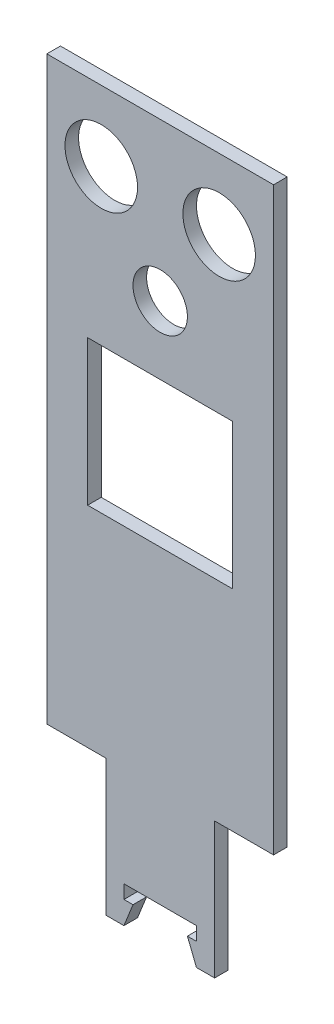
ISO-10303-21;
HEADER;
FILE_DESCRIPTION(('STEP AP214'),'2;1');
FILE_NAME('part.step','',(''),(''),'','','');
FILE_SCHEMA(('AUTOMOTIVE_DESIGN { 1 0 10303 214 1 1 1 1 }'));
ENDSEC;
DATA;
#1=APPLICATION_CONTEXT('core data for automotive mechanical design processes');
#2=APPLICATION_PROTOCOL_DEFINITION('international standard','automotive_design',2000,#1);
#3=PRODUCT_CONTEXT('',#1,'mechanical');
#4=PRODUCT('Part','Part','',(#3));
#5=PRODUCT_RELATED_PRODUCT_CATEGORY('part','',(#4));
#6=PRODUCT_DEFINITION_FORMATION('','',#4);
#7=PRODUCT_DEFINITION_CONTEXT('part definition',#1,'design');
#8=PRODUCT_DEFINITION('design','',#6,#7);
#9=PRODUCT_DEFINITION_SHAPE('','',#8);
#10=(LENGTH_UNIT() NAMED_UNIT(*) SI_UNIT(.MILLI.,.METRE.));
#11=(NAMED_UNIT(*) PLANE_ANGLE_UNIT() SI_UNIT($,.RADIAN.));
#12=(NAMED_UNIT(*) SI_UNIT($,.STERADIAN.) SOLID_ANGLE_UNIT());
#13=UNCERTAINTY_MEASURE_WITH_UNIT(LENGTH_MEASURE(1.E-05),#10,'distance_accuracy_value','');
#14=(GEOMETRIC_REPRESENTATION_CONTEXT(3) GLOBAL_UNCERTAINTY_ASSIGNED_CONTEXT((#13)) GLOBAL_UNIT_ASSIGNED_CONTEXT((#10,
#11,#12)) REPRESENTATION_CONTEXT('',''));
#15=CARTESIAN_POINT('',(0.,0.,0.));
#16=DIRECTION('',(0.,0.,1.));
#17=DIRECTION('',(1.,0.,0.));
#18=AXIS2_PLACEMENT_3D('',#15,#16,#17);
#19=CARTESIAN_POINT('',(0.,0.,3.));
#20=DIRECTION('',(0.,0.,1.));
#21=DIRECTION('',(1.,0.,0.));
#22=AXIS2_PLACEMENT_3D('',#19,#20,#21);
#23=PLANE('',#22);
#24=CARTESIAN_POINT('',(20.7498,74.50776192,3.));
#25=DIRECTION('',(0.,0.,1.));
#26=DIRECTION('',(1.,0.,0.));
#27=AXIS2_PLACEMENT_3D('',#24,#25,#26);
#28=CIRCLE('',#27,8.);
#29=CARTESIAN_POINT('',(28.7498,74.50776192,3.));
#30=VERTEX_POINT('',#29);
#31=EDGE_CURVE('E212',#30,#30,#28,.T.);
#32=ORIENTED_EDGE('',*,*,#31,.F.);
#33=EDGE_LOOP('',(#32));
#34=FACE_BOUND('',#33,.T.);
#35=DIRECTION('',(-1.,0.,0.));
#36=VECTOR('',#35,1.);
#37=CARTESIAN_POINT('',(58.7498,90.00776192,3.));
#38=LINE('',#37,#36);
#39=CARTESIAN_POINT('',(58.7498,90.00776192,3.));
#40=VERTEX_POINT('',#39);
#41=CARTESIAN_POINT('',(8.74979999999999,90.00776192,3.));
#42=VERTEX_POINT('',#41);
#43=EDGE_CURVE('E224',#40,#42,#38,.T.);
#44=ORIENTED_EDGE('',*,*,#43,.T.);
#45=DIRECTION('',(0.,-1.,0.));
#46=VECTOR('',#45,1.);
#47=CARTESIAN_POINT('',(8.74979999999999,90.00776192,3.));
#48=LINE('',#47,#46);
#49=CARTESIAN_POINT('',(8.74979999999999,-37.99223808,3.));
#50=VERTEX_POINT('',#49);
#51=EDGE_CURVE('E227',#42,#50,#48,.T.);
#52=ORIENTED_EDGE('',*,*,#51,.T.);
#53=DIRECTION('',(1.,0.,0.));
#54=VECTOR('',#53,1.);
#55=CARTESIAN_POINT('',(8.74979999999999,-37.99223808,3.));
#56=LINE('',#55,#54);
#57=CARTESIAN_POINT('',(21.7498,-37.99223808,3.));
#58=VERTEX_POINT('',#57);
#59=EDGE_CURVE('E230',#50,#58,#56,.T.);
#60=ORIENTED_EDGE('',*,*,#59,.T.);
#61=DIRECTION('',(0.,-1.,0.));
#62=VECTOR('',#61,1.);
#63=CARTESIAN_POINT('',(21.7498,-37.99223808,3.));
#64=LINE('',#63,#62);
#65=CARTESIAN_POINT('',(21.7498,-67.99223808,3.));
#66=VERTEX_POINT('',#65);
#67=EDGE_CURVE('E232',#58,#66,#64,.T.);
#68=ORIENTED_EDGE('',*,*,#67,.T.);
#69=DIRECTION('',(1.,0.,0.));
#70=VECTOR('',#69,1.);
#71=CARTESIAN_POINT('',(21.7498,-67.99223808,3.));
#72=LINE('',#71,#70);
#73=CARTESIAN_POINT('',(25.7498,-67.99223808,3.));
#74=VERTEX_POINT('',#73);
#75=EDGE_CURVE('E234',#66,#74,#72,.T.);
#76=ORIENTED_EDGE('',*,*,#75,.T.);
#77=DIRECTION('',(0.371390676354105,0.928476690885259,0.));
#78=VECTOR('',#77,1.);
#79=CARTESIAN_POINT('',(25.7498,-67.99223808,3.));
#80=LINE('',#79,#78);
#81=CARTESIAN_POINT('',(27.7498,-62.99223808,3.));
#82=VERTEX_POINT('',#81);
#83=EDGE_CURVE('E236',#74,#82,#80,.T.);
#84=ORIENTED_EDGE('',*,*,#83,.T.);
#85=DIRECTION('',(-1.,0.,0.));
#86=VECTOR('',#85,1.);
#87=CARTESIAN_POINT('',(27.7498,-62.99223808,3.));
#88=LINE('',#87,#86);
#89=CARTESIAN_POINT('',(25.7498,-62.99223808,3.));
#90=VERTEX_POINT('',#89);
#91=EDGE_CURVE('E238',#82,#90,#88,.T.);
#92=ORIENTED_EDGE('',*,*,#91,.T.);
#93=DIRECTION('',(0.,1.,0.));
#94=VECTOR('',#93,1.);
#95=CARTESIAN_POINT('',(25.7498,-62.99223808,3.));
#96=LINE('',#95,#94);
#97=CARTESIAN_POINT('',(25.7498,-59.99223808,3.));
#98=VERTEX_POINT('',#97);
#99=EDGE_CURVE('E240',#90,#98,#96,.T.);
#100=ORIENTED_EDGE('',*,*,#99,.T.);
#101=DIRECTION('',(1.,0.,0.));
#102=VECTOR('',#101,1.);
#103=CARTESIAN_POINT('',(25.7498,-59.99223808,3.));
#104=LINE('',#103,#102);
#105=CARTESIAN_POINT('',(41.7498,-59.99223808,3.));
#106=VERTEX_POINT('',#105);
#107=EDGE_CURVE('E242',#98,#106,#104,.T.);
#108=ORIENTED_EDGE('',*,*,#107,.T.);
#109=DIRECTION('',(0.,-1.,0.));
#110=VECTOR('',#109,1.);
#111=CARTESIAN_POINT('',(41.7498,-59.99223808,3.));
#112=LINE('',#111,#110);
#113=CARTESIAN_POINT('',(41.7498,-62.99223808,3.));
#114=VERTEX_POINT('',#113);
#115=EDGE_CURVE('E244',#106,#114,#112,.T.);
#116=ORIENTED_EDGE('',*,*,#115,.T.);
#117=DIRECTION('',(-1.,0.,0.));
#118=VECTOR('',#117,1.);
#119=CARTESIAN_POINT('',(41.7498,-62.99223808,3.));
#120=LINE('',#119,#118);
#121=CARTESIAN_POINT('',(39.7498,-62.99223808,3.));
#122=VERTEX_POINT('',#121);
#123=EDGE_CURVE('E246',#114,#122,#120,.T.);
#124=ORIENTED_EDGE('',*,*,#123,.T.);
#125=DIRECTION('',(0.371390676354105,-0.928476690885259,0.));
#126=VECTOR('',#125,1.);
#127=CARTESIAN_POINT('',(39.7498,-62.99223808,3.));
#128=LINE('',#127,#126);
#129=CARTESIAN_POINT('',(41.7498,-67.99223808,3.));
#130=VERTEX_POINT('',#129);
#131=EDGE_CURVE('E248',#122,#130,#128,.T.);
#132=ORIENTED_EDGE('',*,*,#131,.T.);
#133=DIRECTION('',(1.,0.,0.));
#134=VECTOR('',#133,1.);
#135=CARTESIAN_POINT('',(41.7498,-67.99223808,3.));
#136=LINE('',#135,#134);
#137=CARTESIAN_POINT('',(45.7498,-67.99223808,3.));
#138=VERTEX_POINT('',#137);
#139=EDGE_CURVE('E250',#130,#138,#136,.T.);
#140=ORIENTED_EDGE('',*,*,#139,.T.);
#141=DIRECTION('',(0.,1.,0.));
#142=VECTOR('',#141,1.);
#143=CARTESIAN_POINT('',(45.7498,-67.99223808,3.));
#144=LINE('',#143,#142);
#145=CARTESIAN_POINT('',(45.7498,-37.99223808,3.));
#146=VERTEX_POINT('',#145);
#147=EDGE_CURVE('E252',#138,#146,#144,.T.);
#148=ORIENTED_EDGE('',*,*,#147,.T.);
#149=DIRECTION('',(1.,0.,0.));
#150=VECTOR('',#149,1.);
#151=CARTESIAN_POINT('',(45.7498,-37.99223808,3.));
#152=LINE('',#151,#150);
#153=CARTESIAN_POINT('',(58.7498,-37.99223808,3.));
#154=VERTEX_POINT('',#153);
#155=EDGE_CURVE('E254',#146,#154,#152,.T.);
#156=ORIENTED_EDGE('',*,*,#155,.T.);
#157=DIRECTION('',(0.,1.,0.));
#158=VECTOR('',#157,1.);
#159=CARTESIAN_POINT('',(58.7498,90.00776192,3.));
#160=LINE('',#159,#158);
#161=EDGE_CURVE('E256',#154,#40,#160,.T.);
#162=ORIENTED_EDGE('',*,*,#161,.T.);
#163=EDGE_LOOP('',(#44,#52,#60,#68,#76,#84,#92,#100,#108,#116,#124,#132,#140,#148,#156,#162));
#164=FACE_BOUND('',#163,.T.);
#165=CARTESIAN_POINT('',(33.7498,55.30776192,3.));
#166=DIRECTION('',(0.,0.,1.));
#167=DIRECTION('',(1.,0.,0.));
#168=AXIS2_PLACEMENT_3D('',#165,#166,#167);
#169=CIRCLE('',#168,6.);
#170=CARTESIAN_POINT('',(39.7498,55.30776192,3.));
#171=VERTEX_POINT('',#170);
#172=EDGE_CURVE('E218',#171,#171,#169,.T.);
#173=ORIENTED_EDGE('',*,*,#172,.F.);
#174=EDGE_LOOP('',(#173));
#175=FACE_BOUND('',#174,.T.);
#176=CARTESIAN_POINT('',(46.7498,74.50776192,3.));
#177=DIRECTION('',(0.,0.,1.));
#178=DIRECTION('',(1.,0.,0.));
#179=AXIS2_PLACEMENT_3D('',#176,#177,#178);
#180=CIRCLE('',#179,8.);
#181=CARTESIAN_POINT('',(54.7498,74.50776192,3.));
#182=VERTEX_POINT('',#181);
#183=EDGE_CURVE('E206',#182,#182,#180,.T.);
#184=ORIENTED_EDGE('',*,*,#183,.F.);
#185=EDGE_LOOP('',(#184));
#186=FACE_BOUND('',#185,.T.);
#187=DIRECTION('',(0.,-1.,0.));
#188=VECTOR('',#187,1.);
#189=CARTESIAN_POINT('',(17.7498,8.30776191999998,3.));
#190=LINE('',#189,#188);
#191=CARTESIAN_POINT('',(17.7498,40.30776192,3.));
#192=VERTEX_POINT('',#191);
#193=CARTESIAN_POINT('',(17.7498,8.30776191999998,3.));
#194=VERTEX_POINT('',#193);
#195=EDGE_CURVE('E178',#192,#194,#190,.T.);
#196=ORIENTED_EDGE('',*,*,#195,.F.);
#197=DIRECTION('',(-1.,0.,0.));
#198=VECTOR('',#197,1.);
#199=CARTESIAN_POINT('',(17.7498,40.30776192,3.));
#200=LINE('',#199,#198);
#201=CARTESIAN_POINT('',(49.7498,40.30776192,3.));
#202=VERTEX_POINT('',#201);
#203=EDGE_CURVE('E170',#202,#192,#200,.T.);
#204=ORIENTED_EDGE('',*,*,#203,.F.);
#205=DIRECTION('',(0.,1.,0.));
#206=VECTOR('',#205,1.);
#207=CARTESIAN_POINT('',(49.7498,40.30776192,3.));
#208=LINE('',#207,#206);
#209=CARTESIAN_POINT('',(49.7498,8.30776191999998,3.));
#210=VERTEX_POINT('',#209);
#211=EDGE_CURVE('E192',#210,#202,#208,.T.);
#212=ORIENTED_EDGE('',*,*,#211,.F.);
#213=DIRECTION('',(1.,0.,0.));
#214=VECTOR('',#213,1.);
#215=CARTESIAN_POINT('',(49.7498,8.30776191999998,3.));
#216=LINE('',#215,#214);
#217=EDGE_CURVE('E190',#194,#210,#216,.T.);
#218=ORIENTED_EDGE('',*,*,#217,.F.);
#219=EDGE_LOOP('',(#196,#204,#212,#218));
#220=FACE_BOUND('',#219,.T.);
#221=ADVANCED_FACE('F33',(#34,#164,#175,#186,#220),#23,.T.);
#222=CARTESIAN_POINT('',(0.,0.,0.));
#223=DIRECTION('',(0.,0.,1.));
#224=DIRECTION('',(1.,0.,0.));
#225=AXIS2_PLACEMENT_3D('',#222,#223,#224);
#226=PLANE('',#225);
#227=CARTESIAN_POINT('',(46.7498,74.50776192,0.));
#228=DIRECTION('',(0.,0.,1.));
#229=DIRECTION('',(1.,0.,0.));
#230=AXIS2_PLACEMENT_3D('',#227,#228,#229);
#231=CIRCLE('',#230,8.);
#232=CARTESIAN_POINT('',(54.7498,74.50776192,0.));
#233=VERTEX_POINT('',#232);
#234=EDGE_CURVE('E186',#233,#233,#231,.T.);
#235=ORIENTED_EDGE('',*,*,#234,.T.);
#236=EDGE_LOOP('',(#235));
#237=FACE_BOUND('',#236,.T.);
#238=CARTESIAN_POINT('',(20.7498,74.50776192,0.));
#239=DIRECTION('',(0.,0.,1.));
#240=DIRECTION('',(1.,0.,0.));
#241=AXIS2_PLACEMENT_3D('',#238,#239,#240);
#242=CIRCLE('',#241,8.);
#243=CARTESIAN_POINT('',(28.7498,74.50776192,0.));
#244=VERTEX_POINT('',#243);
#245=EDGE_CURVE('E209',#244,#244,#242,.T.);
#246=ORIENTED_EDGE('',*,*,#245,.T.);
#247=EDGE_LOOP('',(#246));
#248=FACE_BOUND('',#247,.T.);
#249=CARTESIAN_POINT('',(33.7498,55.30776192,0.));
#250=DIRECTION('',(0.,0.,1.));
#251=DIRECTION('',(1.,0.,0.));
#252=AXIS2_PLACEMENT_3D('',#249,#250,#251);
#253=CIRCLE('',#252,6.);
#254=CARTESIAN_POINT('',(39.7498,55.30776192,0.));
#255=VERTEX_POINT('',#254);
#256=EDGE_CURVE('E215',#255,#255,#253,.T.);
#257=ORIENTED_EDGE('',*,*,#256,.T.);
#258=EDGE_LOOP('',(#257));
#259=FACE_BOUND('',#258,.T.);
#260=DIRECTION('',(-1.,0.,0.));
#261=VECTOR('',#260,1.);
#262=CARTESIAN_POINT('',(58.7498,90.00776192,0.));
#263=LINE('',#262,#261);
#264=CARTESIAN_POINT('',(58.7498,90.00776192,0.));
#265=VERTEX_POINT('',#264);
#266=CARTESIAN_POINT('',(8.74979999999999,90.00776192,0.));
#267=VERTEX_POINT('',#266);
#268=EDGE_CURVE('E221',#265,#267,#263,.T.);
#269=ORIENTED_EDGE('',*,*,#268,.F.);
#270=DIRECTION('',(0.,1.,0.));
#271=VECTOR('',#270,1.);
#272=CARTESIAN_POINT('',(58.7498,90.00776192,0.));
#273=LINE('',#272,#271);
#274=CARTESIAN_POINT('',(58.7498,-37.99223808,0.));
#275=VERTEX_POINT('',#274);
#276=EDGE_CURVE('E228',#275,#265,#273,.T.);
#277=ORIENTED_EDGE('',*,*,#276,.F.);
#278=DIRECTION('',(1.,0.,0.));
#279=VECTOR('',#278,1.);
#280=CARTESIAN_POINT('',(45.7498,-37.99223808,0.));
#281=LINE('',#280,#279);
#282=CARTESIAN_POINT('',(45.7498,-37.99223808,0.));
#283=VERTEX_POINT('',#282);
#284=EDGE_CURVE('E287',#283,#275,#281,.T.);
#285=ORIENTED_EDGE('',*,*,#284,.F.);
#286=DIRECTION('',(0.,1.,0.));
#287=VECTOR('',#286,1.);
#288=CARTESIAN_POINT('',(45.7498,-67.99223808,0.));
#289=LINE('',#288,#287);
#290=CARTESIAN_POINT('',(45.7498,-67.99223808,0.));
#291=VERTEX_POINT('',#290);
#292=EDGE_CURVE('E285',#291,#283,#289,.T.);
#293=ORIENTED_EDGE('',*,*,#292,.F.);
#294=DIRECTION('',(1.,0.,0.));
#295=VECTOR('',#294,1.);
#296=CARTESIAN_POINT('',(41.7498,-67.99223808,0.));
#297=LINE('',#296,#295);
#298=CARTESIAN_POINT('',(41.7498,-67.99223808,0.));
#299=VERTEX_POINT('',#298);
#300=EDGE_CURVE('E283',#299,#291,#297,.T.);
#301=ORIENTED_EDGE('',*,*,#300,.F.);
#302=DIRECTION('',(0.371390676354105,-0.928476690885259,0.));
#303=VECTOR('',#302,1.);
#304=CARTESIAN_POINT('',(39.7498,-62.99223808,0.));
#305=LINE('',#304,#303);
#306=CARTESIAN_POINT('',(39.7498,-62.99223808,0.));
#307=VERTEX_POINT('',#306);
#308=EDGE_CURVE('E281',#307,#299,#305,.T.);
#309=ORIENTED_EDGE('',*,*,#308,.F.);
#310=DIRECTION('',(-1.,0.,0.));
#311=VECTOR('',#310,1.);
#312=CARTESIAN_POINT('',(41.7498,-62.99223808,0.));
#313=LINE('',#312,#311);
#314=CARTESIAN_POINT('',(41.7498,-62.99223808,0.));
#315=VERTEX_POINT('',#314);
#316=EDGE_CURVE('E279',#315,#307,#313,.T.);
#317=ORIENTED_EDGE('',*,*,#316,.F.);
#318=DIRECTION('',(0.,-1.,0.));
#319=VECTOR('',#318,1.);
#320=CARTESIAN_POINT('',(41.7498,-59.99223808,0.));
#321=LINE('',#320,#319);
#322=CARTESIAN_POINT('',(41.7498,-59.99223808,0.));
#323=VERTEX_POINT('',#322);
#324=EDGE_CURVE('E277',#323,#315,#321,.T.);
#325=ORIENTED_EDGE('',*,*,#324,.F.);
#326=DIRECTION('',(1.,0.,0.));
#327=VECTOR('',#326,1.);
#328=CARTESIAN_POINT('',(25.7498,-59.99223808,0.));
#329=LINE('',#328,#327);
#330=CARTESIAN_POINT('',(25.7498,-59.99223808,0.));
#331=VERTEX_POINT('',#330);
#332=EDGE_CURVE('E275',#331,#323,#329,.T.);
#333=ORIENTED_EDGE('',*,*,#332,.F.);
#334=DIRECTION('',(0.,1.,0.));
#335=VECTOR('',#334,1.);
#336=CARTESIAN_POINT('',(25.7498,-62.99223808,0.));
#337=LINE('',#336,#335);
#338=CARTESIAN_POINT('',(25.7498,-62.99223808,0.));
#339=VERTEX_POINT('',#338);
#340=EDGE_CURVE('E273',#339,#331,#337,.T.);
#341=ORIENTED_EDGE('',*,*,#340,.F.);
#342=DIRECTION('',(-1.,0.,0.));
#343=VECTOR('',#342,1.);
#344=CARTESIAN_POINT('',(27.7498,-62.99223808,0.));
#345=LINE('',#344,#343);
#346=CARTESIAN_POINT('',(27.7498,-62.99223808,0.));
#347=VERTEX_POINT('',#346);
#348=EDGE_CURVE('E271',#347,#339,#345,.T.);
#349=ORIENTED_EDGE('',*,*,#348,.F.);
#350=DIRECTION('',(0.371390676354105,0.928476690885259,0.));
#351=VECTOR('',#350,1.);
#352=CARTESIAN_POINT('',(25.7498,-67.99223808,0.));
#353=LINE('',#352,#351);
#354=CARTESIAN_POINT('',(25.7498,-67.99223808,0.));
#355=VERTEX_POINT('',#354);
#356=EDGE_CURVE('E269',#355,#347,#353,.T.);
#357=ORIENTED_EDGE('',*,*,#356,.F.);
#358=DIRECTION('',(1.,0.,0.));
#359=VECTOR('',#358,1.);
#360=CARTESIAN_POINT('',(21.7498,-67.99223808,0.));
#361=LINE('',#360,#359);
#362=CARTESIAN_POINT('',(21.7498,-67.99223808,0.));
#363=VERTEX_POINT('',#362);
#364=EDGE_CURVE('E267',#363,#355,#361,.T.);
#365=ORIENTED_EDGE('',*,*,#364,.F.);
#366=DIRECTION('',(0.,-1.,0.));
#367=VECTOR('',#366,1.);
#368=CARTESIAN_POINT('',(21.7498,-37.99223808,0.));
#369=LINE('',#368,#367);
#370=CARTESIAN_POINT('',(21.7498,-37.99223808,0.));
#371=VERTEX_POINT('',#370);
#372=EDGE_CURVE('E265',#371,#363,#369,.T.);
#373=ORIENTED_EDGE('',*,*,#372,.F.);
#374=DIRECTION('',(1.,0.,0.));
#375=VECTOR('',#374,1.);
#376=CARTESIAN_POINT('',(8.74979999999999,-37.99223808,0.));
#377=LINE('',#376,#375);
#378=CARTESIAN_POINT('',(8.74979999999999,-37.99223808,0.));
#379=VERTEX_POINT('',#378);
#380=EDGE_CURVE('E263',#379,#371,#377,.T.);
#381=ORIENTED_EDGE('',*,*,#380,.F.);
#382=DIRECTION('',(0.,-1.,0.));
#383=VECTOR('',#382,1.);
#384=CARTESIAN_POINT('',(8.74979999999999,90.00776192,0.));
#385=LINE('',#384,#383);
#386=EDGE_CURVE('E261',#267,#379,#385,.T.);
#387=ORIENTED_EDGE('',*,*,#386,.F.);
#388=EDGE_LOOP('',(#269,#277,#285,#293,#301,#309,#317,#325,#333,#341,#349,#357,#365,#373,#381,#387));
#389=FACE_BOUND('',#388,.T.);
#390=DIRECTION('',(-1.,0.,0.));
#391=VECTOR('',#390,1.);
#392=CARTESIAN_POINT('',(17.7498,40.30776192,0.));
#393=LINE('',#392,#391);
#394=CARTESIAN_POINT('',(49.7498,40.30776192,0.));
#395=VERTEX_POINT('',#394);
#396=CARTESIAN_POINT('',(17.7498,40.30776192,0.));
#397=VERTEX_POINT('',#396);
#398=EDGE_CURVE('E56',#395,#397,#393,.T.);
#399=ORIENTED_EDGE('',*,*,#398,.T.);
#400=DIRECTION('',(0.,-1.,0.));
#401=VECTOR('',#400,1.);
#402=CARTESIAN_POINT('',(17.7498,8.30776191999998,0.));
#403=LINE('',#402,#401);
#404=CARTESIAN_POINT('',(17.7498,8.30776191999998,0.));
#405=VERTEX_POINT('',#404);
#406=EDGE_CURVE('E185',#397,#405,#403,.T.);
#407=ORIENTED_EDGE('',*,*,#406,.T.);
#408=DIRECTION('',(1.,0.,0.));
#409=VECTOR('',#408,1.);
#410=CARTESIAN_POINT('',(49.7498,8.30776191999998,0.));
#411=LINE('',#410,#409);
#412=CARTESIAN_POINT('',(49.7498,8.30776191999998,0.));
#413=VERTEX_POINT('',#412);
#414=EDGE_CURVE('E198',#405,#413,#411,.T.);
#415=ORIENTED_EDGE('',*,*,#414,.T.);
#416=DIRECTION('',(0.,1.,0.));
#417=VECTOR('',#416,1.);
#418=CARTESIAN_POINT('',(49.7498,40.30776192,0.));
#419=LINE('',#418,#417);
#420=EDGE_CURVE('E179',#413,#395,#419,.T.);
#421=ORIENTED_EDGE('',*,*,#420,.T.);
#422=EDGE_LOOP('',(#399,#407,#415,#421));
#423=FACE_BOUND('',#422,.T.);
#424=ADVANCED_FACE('F341',(#237,#248,#259,#389,#423),#226,.F.);
#425=CARTESIAN_POINT('',(58.7498,90.00776192,3.));
#426=DIRECTION('',(0.,-1.,0.));
#427=DIRECTION('',(0.,0.,-1.));
#428=AXIS2_PLACEMENT_3D('',#425,#426,#427);
#429=PLANE('',#428);
#430=ORIENTED_EDGE('',*,*,#268,.T.);
#431=DIRECTION('',(0.,0.,-1.));
#432=VECTOR('',#431,1.);
#433=CARTESIAN_POINT('',(8.74979999999999,90.00776192,3.));
#434=LINE('',#433,#432);
#435=EDGE_CURVE('E11',#42,#267,#434,.T.);
#436=ORIENTED_EDGE('',*,*,#435,.F.);
#437=ORIENTED_EDGE('',*,*,#43,.F.);
#438=DIRECTION('',(0.,0.,-1.));
#439=VECTOR('',#438,1.);
#440=CARTESIAN_POINT('',(58.7498,90.00776192,3.));
#441=LINE('',#440,#439);
#442=EDGE_CURVE('E258',#40,#265,#441,.T.);
#443=ORIENTED_EDGE('',*,*,#442,.T.);
#444=EDGE_LOOP('',(#430,#436,#437,#443));
#445=FACE_BOUND('',#444,.T.);
#446=ADVANCED_FACE('F35',(#445),#429,.F.);
#447=CARTESIAN_POINT('',(8.74979999999999,90.00776192,3.));
#448=DIRECTION('',(1.,0.,0.));
#449=DIRECTION('',(0.,0.,-1.));
#450=AXIS2_PLACEMENT_3D('',#447,#448,#449);
#451=PLANE('',#450);
#452=ORIENTED_EDGE('',*,*,#386,.T.);
#453=DIRECTION('',(0.,0.,-1.));
#454=VECTOR('',#453,1.);
#455=CARTESIAN_POINT('',(8.74979999999999,-37.99223808,3.));
#456=LINE('',#455,#454);
#457=EDGE_CURVE('E41',#50,#379,#456,.T.);
#458=ORIENTED_EDGE('',*,*,#457,.F.);
#459=ORIENTED_EDGE('',*,*,#51,.F.);
#460=ORIENTED_EDGE('',*,*,#435,.T.);
#461=EDGE_LOOP('',(#452,#458,#459,#460));
#462=FACE_BOUND('',#461,.T.);
#463=ADVANCED_FACE('F359',(#462),#451,.F.);
#464=CARTESIAN_POINT('',(8.74979999999999,-37.99223808,3.));
#465=DIRECTION('',(0.,1.,0.));
#466=DIRECTION('',(0.,0.,1.));
#467=AXIS2_PLACEMENT_3D('',#464,#465,#466);
#468=PLANE('',#467);
#469=ORIENTED_EDGE('',*,*,#380,.T.);
#470=DIRECTION('',(0.,0.,-1.));
#471=VECTOR('',#470,1.);
#472=CARTESIAN_POINT('',(21.7498,-37.99223808,3.));
#473=LINE('',#472,#471);
#474=EDGE_CURVE('E328',#58,#371,#473,.T.);
#475=ORIENTED_EDGE('',*,*,#474,.F.);
#476=ORIENTED_EDGE('',*,*,#59,.F.);
#477=ORIENTED_EDGE('',*,*,#457,.T.);
#478=EDGE_LOOP('',(#469,#475,#476,#477));
#479=FACE_BOUND('',#478,.T.);
#480=ADVANCED_FACE('F335',(#479),#468,.F.);
#481=CARTESIAN_POINT('',(21.7498,-37.99223808,3.));
#482=DIRECTION('',(1.,0.,0.));
#483=DIRECTION('',(0.,0.,-1.));
#484=AXIS2_PLACEMENT_3D('',#481,#482,#483);
#485=PLANE('',#484);
#486=ORIENTED_EDGE('',*,*,#372,.T.);
#487=DIRECTION('',(0.,0.,-1.));
#488=VECTOR('',#487,1.);
#489=CARTESIAN_POINT('',(21.7498,-67.99223808,3.));
#490=LINE('',#489,#488);
#491=EDGE_CURVE('E325',#66,#363,#490,.T.);
#492=ORIENTED_EDGE('',*,*,#491,.F.);
#493=ORIENTED_EDGE('',*,*,#67,.F.);
#494=ORIENTED_EDGE('',*,*,#474,.T.);
#495=EDGE_LOOP('',(#486,#492,#493,#494));
#496=FACE_BOUND('',#495,.T.);
#497=ADVANCED_FACE('F347',(#496),#485,.F.);
#498=CARTESIAN_POINT('',(21.7498,-67.99223808,3.));
#499=DIRECTION('',(0.,1.,0.));
#500=DIRECTION('',(0.,0.,1.));
#501=AXIS2_PLACEMENT_3D('',#498,#499,#500);
#502=PLANE('',#501);
#503=ORIENTED_EDGE('',*,*,#364,.T.);
#504=DIRECTION('',(0.,0.,-1.));
#505=VECTOR('',#504,1.);
#506=CARTESIAN_POINT('',(25.7498,-67.99223808,3.));
#507=LINE('',#506,#505);
#508=EDGE_CURVE('E322',#74,#355,#507,.T.);
#509=ORIENTED_EDGE('',*,*,#508,.F.);
#510=ORIENTED_EDGE('',*,*,#75,.F.);
#511=ORIENTED_EDGE('',*,*,#491,.T.);
#512=EDGE_LOOP('',(#503,#509,#510,#511));
#513=FACE_BOUND('',#512,.T.);
#514=ADVANCED_FACE('F351',(#513),#502,.F.);
#515=CARTESIAN_POINT('',(25.7498,-67.99223808,3.));
#516=DIRECTION('',(-0.928476690885259,0.371390676354104,0.));
#517=DIRECTION('',(-0.371390676354105,-0.928476690885259,0.));
#518=AXIS2_PLACEMENT_3D('',#515,#516,#517);
#519=PLANE('',#518);
#520=ORIENTED_EDGE('',*,*,#356,.T.);
#521=DIRECTION('',(0.,0.,-1.));
#522=VECTOR('',#521,1.);
#523=CARTESIAN_POINT('',(27.7498,-62.99223808,3.));
#524=LINE('',#523,#522);
#525=EDGE_CURVE('E319',#82,#347,#524,.T.);
#526=ORIENTED_EDGE('',*,*,#525,.F.);
#527=ORIENTED_EDGE('',*,*,#83,.F.);
#528=ORIENTED_EDGE('',*,*,#508,.T.);
#529=EDGE_LOOP('',(#520,#526,#527,#528));
#530=FACE_BOUND('',#529,.T.);
#531=ADVANCED_FACE('F412',(#530),#519,.F.);
#532=CARTESIAN_POINT('',(27.7498,-62.99223808,3.));
#533=DIRECTION('',(0.,-1.,0.));
#534=DIRECTION('',(0.,0.,-1.));
#535=AXIS2_PLACEMENT_3D('',#532,#533,#534);
#536=PLANE('',#535);
#537=ORIENTED_EDGE('',*,*,#348,.T.);
#538=DIRECTION('',(0.,0.,-1.));
#539=VECTOR('',#538,1.);
#540=CARTESIAN_POINT('',(25.7498,-62.99223808,3.));
#541=LINE('',#540,#539);
#542=EDGE_CURVE('E316',#90,#339,#541,.T.);
#543=ORIENTED_EDGE('',*,*,#542,.F.);
#544=ORIENTED_EDGE('',*,*,#91,.F.);
#545=ORIENTED_EDGE('',*,*,#525,.T.);
#546=EDGE_LOOP('',(#537,#543,#544,#545));
#547=FACE_BOUND('',#546,.T.);
#548=ADVANCED_FACE('F409',(#547),#536,.F.);
#549=CARTESIAN_POINT('',(25.7498,-62.99223808,3.));
#550=DIRECTION('',(-1.,0.,0.));
#551=DIRECTION('',(0.,0.,1.));
#552=AXIS2_PLACEMENT_3D('',#549,#550,#551);
#553=PLANE('',#552);
#554=ORIENTED_EDGE('',*,*,#340,.T.);
#555=DIRECTION('',(0.,0.,-1.));
#556=VECTOR('',#555,1.);
#557=CARTESIAN_POINT('',(25.7498,-59.99223808,3.));
#558=LINE('',#557,#556);
#559=EDGE_CURVE('E313',#98,#331,#558,.T.);
#560=ORIENTED_EDGE('',*,*,#559,.F.);
#561=ORIENTED_EDGE('',*,*,#99,.F.);
#562=ORIENTED_EDGE('',*,*,#542,.T.);
#563=EDGE_LOOP('',(#554,#560,#561,#562));
#564=FACE_BOUND('',#563,.T.);
#565=ADVANCED_FACE('F405',(#564),#553,.F.);
#566=CARTESIAN_POINT('',(25.7498,-59.99223808,3.));
#567=DIRECTION('',(0.,1.,0.));
#568=DIRECTION('',(0.,0.,1.));
#569=AXIS2_PLACEMENT_3D('',#566,#567,#568);
#570=PLANE('',#569);
#571=ORIENTED_EDGE('',*,*,#332,.T.);
#572=DIRECTION('',(0.,0.,-1.));
#573=VECTOR('',#572,1.);
#574=CARTESIAN_POINT('',(41.7498,-59.99223808,3.));
#575=LINE('',#574,#573);
#576=EDGE_CURVE('E310',#106,#323,#575,.T.);
#577=ORIENTED_EDGE('',*,*,#576,.F.);
#578=ORIENTED_EDGE('',*,*,#107,.F.);
#579=ORIENTED_EDGE('',*,*,#559,.T.);
#580=EDGE_LOOP('',(#571,#577,#578,#579));
#581=FACE_BOUND('',#580,.T.);
#582=ADVANCED_FACE('F401',(#581),#570,.F.);
#583=CARTESIAN_POINT('',(41.7498,-59.99223808,3.));
#584=DIRECTION('',(1.,0.,0.));
#585=DIRECTION('',(0.,0.,-1.));
#586=AXIS2_PLACEMENT_3D('',#583,#584,#585);
#587=PLANE('',#586);
#588=ORIENTED_EDGE('',*,*,#324,.T.);
#589=DIRECTION('',(0.,0.,-1.));
#590=VECTOR('',#589,1.);
#591=CARTESIAN_POINT('',(41.7498,-62.99223808,3.));
#592=LINE('',#591,#590);
#593=EDGE_CURVE('E307',#114,#315,#592,.T.);
#594=ORIENTED_EDGE('',*,*,#593,.F.);
#595=ORIENTED_EDGE('',*,*,#115,.F.);
#596=ORIENTED_EDGE('',*,*,#576,.T.);
#597=EDGE_LOOP('',(#588,#594,#595,#596));
#598=FACE_BOUND('',#597,.T.);
#599=ADVANCED_FACE('F396',(#598),#587,.F.);
#600=CARTESIAN_POINT('',(41.7498,-62.99223808,3.));
#601=DIRECTION('',(0.,-1.,0.));
#602=DIRECTION('',(0.,0.,-1.));
#603=AXIS2_PLACEMENT_3D('',#600,#601,#602);
#604=PLANE('',#603);
#605=ORIENTED_EDGE('',*,*,#316,.T.);
#606=DIRECTION('',(0.,0.,-1.));
#607=VECTOR('',#606,1.);
#608=CARTESIAN_POINT('',(39.7498,-62.99223808,3.));
#609=LINE('',#608,#607);
#610=EDGE_CURVE('E304',#122,#307,#609,.T.);
#611=ORIENTED_EDGE('',*,*,#610,.F.);
#612=ORIENTED_EDGE('',*,*,#123,.F.);
#613=ORIENTED_EDGE('',*,*,#593,.T.);
#614=EDGE_LOOP('',(#605,#611,#612,#613));
#615=FACE_BOUND('',#614,.T.);
#616=ADVANCED_FACE('F390',(#615),#604,.F.);
#617=CARTESIAN_POINT('',(39.7498,-62.99223808,3.));
#618=DIRECTION('',(0.928476690885259,0.371390676354104,0.));
#619=DIRECTION('',(-0.371390676354105,0.928476690885259,0.));
#620=AXIS2_PLACEMENT_3D('',#617,#618,#619);
#621=PLANE('',#620);
#622=ORIENTED_EDGE('',*,*,#308,.T.);
#623=DIRECTION('',(0.,0.,-1.));
#624=VECTOR('',#623,1.);
#625=CARTESIAN_POINT('',(41.7498,-67.99223808,3.));
#626=LINE('',#625,#624);
#627=EDGE_CURVE('E301',#130,#299,#626,.T.);
#628=ORIENTED_EDGE('',*,*,#627,.F.);
#629=ORIENTED_EDGE('',*,*,#131,.F.);
#630=ORIENTED_EDGE('',*,*,#610,.T.);
#631=EDGE_LOOP('',(#622,#628,#629,#630));
#632=FACE_BOUND('',#631,.T.);
#633=ADVANCED_FACE('F386',(#632),#621,.F.);
#634=CARTESIAN_POINT('',(41.7498,-67.99223808,3.));
#635=DIRECTION('',(0.,1.,0.));
#636=DIRECTION('',(0.,0.,1.));
#637=AXIS2_PLACEMENT_3D('',#634,#635,#636);
#638=PLANE('',#637);
#639=ORIENTED_EDGE('',*,*,#300,.T.);
#640=DIRECTION('',(0.,0.,-1.));
#641=VECTOR('',#640,1.);
#642=CARTESIAN_POINT('',(45.7498,-67.99223808,3.));
#643=LINE('',#642,#641);
#644=EDGE_CURVE('E298',#138,#291,#643,.T.);
#645=ORIENTED_EDGE('',*,*,#644,.F.);
#646=ORIENTED_EDGE('',*,*,#139,.F.);
#647=ORIENTED_EDGE('',*,*,#627,.T.);
#648=EDGE_LOOP('',(#639,#645,#646,#647));
#649=FACE_BOUND('',#648,.T.);
#650=ADVANCED_FACE('F381',(#649),#638,.F.);
#651=CARTESIAN_POINT('',(45.7498,-67.99223808,3.));
#652=DIRECTION('',(-1.,0.,0.));
#653=DIRECTION('',(0.,0.,1.));
#654=AXIS2_PLACEMENT_3D('',#651,#652,#653);
#655=PLANE('',#654);
#656=ORIENTED_EDGE('',*,*,#292,.T.);
#657=DIRECTION('',(0.,0.,-1.));
#658=VECTOR('',#657,1.);
#659=CARTESIAN_POINT('',(45.7498,-37.99223808,3.));
#660=LINE('',#659,#658);
#661=EDGE_CURVE('E295',#146,#283,#660,.T.);
#662=ORIENTED_EDGE('',*,*,#661,.F.);
#663=ORIENTED_EDGE('',*,*,#147,.F.);
#664=ORIENTED_EDGE('',*,*,#644,.T.);
#665=EDGE_LOOP('',(#656,#662,#663,#664));
#666=FACE_BOUND('',#665,.T.);
#667=ADVANCED_FACE('F375',(#666),#655,.F.);
#668=CARTESIAN_POINT('',(45.7498,-37.99223808,3.));
#669=DIRECTION('',(0.,1.,0.));
#670=DIRECTION('',(0.,0.,1.));
#671=AXIS2_PLACEMENT_3D('',#668,#669,#670);
#672=PLANE('',#671);
#673=ORIENTED_EDGE('',*,*,#284,.T.);
#674=DIRECTION('',(0.,0.,-1.));
#675=VECTOR('',#674,1.);
#676=CARTESIAN_POINT('',(58.7498,-37.99223808,3.));
#677=LINE('',#676,#675);
#678=EDGE_CURVE('E292',#154,#275,#677,.T.);
#679=ORIENTED_EDGE('',*,*,#678,.F.);
#680=ORIENTED_EDGE('',*,*,#155,.F.);
#681=ORIENTED_EDGE('',*,*,#661,.T.);
#682=EDGE_LOOP('',(#673,#679,#680,#681));
#683=FACE_BOUND('',#682,.T.);
#684=ADVANCED_FACE('F371',(#683),#672,.F.);
#685=CARTESIAN_POINT('',(58.7498,90.00776192,3.));
#686=DIRECTION('',(-1.,0.,0.));
#687=DIRECTION('',(0.,0.,1.));
#688=AXIS2_PLACEMENT_3D('',#685,#686,#687);
#689=PLANE('',#688);
#690=ORIENTED_EDGE('',*,*,#276,.T.);
#691=ORIENTED_EDGE('',*,*,#442,.F.);
#692=ORIENTED_EDGE('',*,*,#161,.F.);
#693=ORIENTED_EDGE('',*,*,#678,.T.);
#694=EDGE_LOOP('',(#690,#691,#692,#693));
#695=FACE_BOUND('',#694,.T.);
#696=ADVANCED_FACE('F366',(#695),#689,.F.);
#697=CARTESIAN_POINT('',(33.7498,55.30776192,3.));
#698=DIRECTION('',(0.,0.,-1.));
#699=DIRECTION('',(-1.,0.,0.));
#700=AXIS2_PLACEMENT_3D('',#697,#698,#699);
#701=CYLINDRICAL_SURFACE('',#700,6.);
#702=ORIENTED_EDGE('',*,*,#172,.T.);
#703=EDGE_LOOP('',(#702));
#704=FACE_BOUND('',#703,.T.);
#705=ORIENTED_EDGE('',*,*,#256,.F.);
#706=EDGE_LOOP('',(#705));
#707=FACE_BOUND('',#706,.T.);
#708=ADVANCED_FACE('F431',(#704,#707),#701,.F.);
#709=CARTESIAN_POINT('',(20.7498,74.50776192,3.));
#710=DIRECTION('',(0.,0.,-1.));
#711=DIRECTION('',(-1.,0.,0.));
#712=AXIS2_PLACEMENT_3D('',#709,#710,#711);
#713=CYLINDRICAL_SURFACE('',#712,8.);
#714=ORIENTED_EDGE('',*,*,#31,.T.);
#715=EDGE_LOOP('',(#714));
#716=FACE_BOUND('',#715,.T.);
#717=ORIENTED_EDGE('',*,*,#245,.F.);
#718=EDGE_LOOP('',(#717));
#719=FACE_BOUND('',#718,.T.);
#720=ADVANCED_FACE('F493',(#716,#719),#713,.F.);
#721=CARTESIAN_POINT('',(46.7498,74.50776192,3.));
#722=DIRECTION('',(0.,0.,-1.));
#723=DIRECTION('',(-1.,0.,0.));
#724=AXIS2_PLACEMENT_3D('',#721,#722,#723);
#725=CYLINDRICAL_SURFACE('',#724,8.);
#726=ORIENTED_EDGE('',*,*,#183,.T.);
#727=EDGE_LOOP('',(#726));
#728=FACE_BOUND('',#727,.T.);
#729=ORIENTED_EDGE('',*,*,#234,.F.);
#730=EDGE_LOOP('',(#729));
#731=FACE_BOUND('',#730,.T.);
#732=ADVANCED_FACE('F500',(#728,#731),#725,.F.);
#733=CARTESIAN_POINT('',(17.7498,40.30776192,3.));
#734=DIRECTION('',(0.,-1.,0.));
#735=DIRECTION('',(0.,0.,-1.));
#736=AXIS2_PLACEMENT_3D('',#733,#734,#735);
#737=PLANE('',#736);
#738=ORIENTED_EDGE('',*,*,#398,.F.);
#739=DIRECTION('',(0.,0.,-1.));
#740=VECTOR('',#739,1.);
#741=CARTESIAN_POINT('',(49.7498,40.30776192,3.));
#742=LINE('',#741,#740);
#743=EDGE_CURVE('E174',#202,#395,#742,.T.);
#744=ORIENTED_EDGE('',*,*,#743,.F.);
#745=ORIENTED_EDGE('',*,*,#203,.T.);
#746=DIRECTION('',(0.,0.,-1.));
#747=VECTOR('',#746,1.);
#748=CARTESIAN_POINT('',(17.7498,40.30776192,3.));
#749=LINE('',#748,#747);
#750=EDGE_CURVE('E173',#192,#397,#749,.T.);
#751=ORIENTED_EDGE('',*,*,#750,.T.);
#752=EDGE_LOOP('',(#738,#744,#745,#751));
#753=FACE_BOUND('',#752,.T.);
#754=ADVANCED_FACE('F172',(#753),#737,.T.);
#755=CARTESIAN_POINT('',(17.7498,8.30776191999998,3.));
#756=DIRECTION('',(1.,0.,0.));
#757=DIRECTION('',(0.,0.,-1.));
#758=AXIS2_PLACEMENT_3D('',#755,#756,#757);
#759=PLANE('',#758);
#760=ORIENTED_EDGE('',*,*,#406,.F.);
#761=ORIENTED_EDGE('',*,*,#750,.F.);
#762=ORIENTED_EDGE('',*,*,#195,.T.);
#763=DIRECTION('',(0.,0.,-1.));
#764=VECTOR('',#763,1.);
#765=CARTESIAN_POINT('',(17.7498,8.30776191999998,3.));
#766=LINE('',#765,#764);
#767=EDGE_CURVE('E187',#194,#405,#766,.T.);
#768=ORIENTED_EDGE('',*,*,#767,.T.);
#769=EDGE_LOOP('',(#760,#761,#762,#768));
#770=FACE_BOUND('',#769,.T.);
#771=ADVANCED_FACE('F182',(#770),#759,.T.);
#772=CARTESIAN_POINT('',(49.7498,8.30776191999998,3.));
#773=DIRECTION('',(0.,1.,0.));
#774=DIRECTION('',(0.,0.,1.));
#775=AXIS2_PLACEMENT_3D('',#772,#773,#774);
#776=PLANE('',#775);
#777=ORIENTED_EDGE('',*,*,#414,.F.);
#778=ORIENTED_EDGE('',*,*,#767,.F.);
#779=ORIENTED_EDGE('',*,*,#217,.T.);
#780=DIRECTION('',(0.,0.,-1.));
#781=VECTOR('',#780,1.);
#782=CARTESIAN_POINT('',(49.7498,8.30776191999998,3.));
#783=LINE('',#782,#781);
#784=EDGE_CURVE('E48',#210,#413,#783,.T.);
#785=ORIENTED_EDGE('',*,*,#784,.T.);
#786=EDGE_LOOP('',(#777,#778,#779,#785));
#787=FACE_BOUND('',#786,.T.);
#788=ADVANCED_FACE('F520',(#787),#776,.T.);
#789=CARTESIAN_POINT('',(49.7498,40.30776192,3.));
#790=DIRECTION('',(-1.,0.,0.));
#791=DIRECTION('',(0.,0.,1.));
#792=AXIS2_PLACEMENT_3D('',#789,#790,#791);
#793=PLANE('',#792);
#794=ORIENTED_EDGE('',*,*,#420,.F.);
#795=ORIENTED_EDGE('',*,*,#784,.F.);
#796=ORIENTED_EDGE('',*,*,#211,.T.);
#797=ORIENTED_EDGE('',*,*,#743,.T.);
#798=EDGE_LOOP('',(#794,#795,#796,#797));
#799=FACE_BOUND('',#798,.T.);
#800=ADVANCED_FACE('F527',(#799),#793,.T.);
#801=CLOSED_SHELL('',(#221,#424,#446,#463,#480,#497,#514,#531,#548,#565,#582,#599,#616,#633,
#650,#667,#684,#696,#708,#720,#732,#754,#771,#788,#800));
#802=MANIFOLD_SOLID_BREP('B2',#801);
#803=ADVANCED_BREP_SHAPE_REPRESENTATION('',(#18,#802),#14);
#804=SHAPE_DEFINITION_REPRESENTATION(#9,#803);
ENDSEC;
END-ISO-10303-21;
